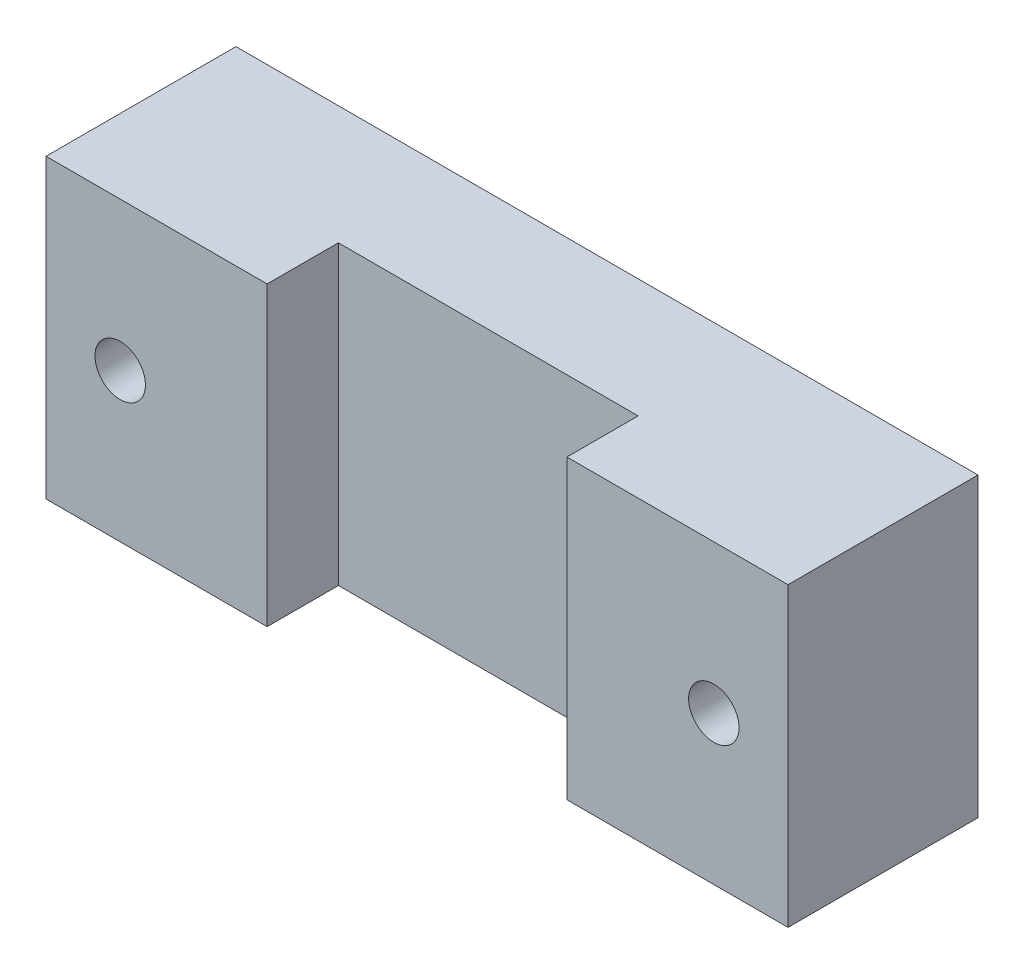
ISO-10303-21;
HEADER;
FILE_DESCRIPTION(('STEP AP214'),'2;1');
FILE_NAME('part.step','',(''),(''),'','','');
FILE_SCHEMA(('AUTOMOTIVE_DESIGN { 1 0 10303 214 1 1 1 1 }'));
ENDSEC;
DATA;
#1=APPLICATION_CONTEXT('core data for automotive mechanical design processes');
#2=APPLICATION_PROTOCOL_DEFINITION('international standard','automotive_design',2000,#1);
#3=PRODUCT_CONTEXT('',#1,'mechanical');
#4=PRODUCT('Part','Part','',(#3));
#5=PRODUCT_RELATED_PRODUCT_CATEGORY('part','',(#4));
#6=PRODUCT_DEFINITION_FORMATION('','',#4);
#7=PRODUCT_DEFINITION_CONTEXT('part definition',#1,'design');
#8=PRODUCT_DEFINITION('design','',#6,#7);
#9=PRODUCT_DEFINITION_SHAPE('','',#8);
#10=(LENGTH_UNIT() NAMED_UNIT(*) SI_UNIT(.MILLI.,.METRE.));
#11=(NAMED_UNIT(*) PLANE_ANGLE_UNIT() SI_UNIT($,.RADIAN.));
#12=(NAMED_UNIT(*) SI_UNIT($,.STERADIAN.) SOLID_ANGLE_UNIT());
#13=UNCERTAINTY_MEASURE_WITH_UNIT(LENGTH_MEASURE(1.E-05),#10,'distance_accuracy_value','');
#14=(GEOMETRIC_REPRESENTATION_CONTEXT(3) GLOBAL_UNCERTAINTY_ASSIGNED_CONTEXT((#13)) GLOBAL_UNIT_ASSIGNED_CONTEXT((#10,
#11,#12)) REPRESENTATION_CONTEXT('',''));
#15=CARTESIAN_POINT('',(0.,0.,0.));
#16=DIRECTION('',(0.,0.,1.));
#17=DIRECTION('',(1.,0.,0.));
#18=AXIS2_PLACEMENT_3D('',#15,#16,#17);
#19=CARTESIAN_POINT('',(0.,0.,8.));
#20=DIRECTION('',(0.,0.,1.));
#21=DIRECTION('',(1.,0.,0.));
#22=AXIS2_PLACEMENT_3D('',#19,#20,#21);
#23=PLANE('',#22);
#24=DIRECTION('',(0.,-1.,0.));
#25=VECTOR('',#24,1.);
#26=CARTESIAN_POINT('',(-10.1,61.6124016104657,8.));
#27=LINE('',#26,#25);
#28=CARTESIAN_POINT('',(-10.1,10.,8.));
#29=VERTEX_POINT('',#28);
#30=CARTESIAN_POINT('',(-10.1,-9.99999999999999,8.));
#31=VERTEX_POINT('',#30);
#32=EDGE_CURVE('E56',#29,#31,#27,.T.);
#33=ORIENTED_EDGE('',*,*,#32,.T.);
#34=DIRECTION('',(1.,0.,0.));
#35=VECTOR('',#34,1.);
#36=CARTESIAN_POINT('',(25.,-9.99999999999999,8.));
#37=LINE('',#36,#35);
#38=CARTESIAN_POINT('',(10.1,-9.99999999999999,8.));
#39=VERTEX_POINT('',#38);
#40=EDGE_CURVE('E51',#31,#39,#37,.T.);
#41=ORIENTED_EDGE('',*,*,#40,.T.);
#42=DIRECTION('',(0.,-1.,0.));
#43=VECTOR('',#42,1.);
#44=CARTESIAN_POINT('',(10.1,61.6124016104657,8.));
#45=LINE('',#44,#43);
#46=CARTESIAN_POINT('',(10.1,10.,8.));
#47=VERTEX_POINT('',#46);
#48=EDGE_CURVE('E144',#47,#39,#45,.T.);
#49=ORIENTED_EDGE('',*,*,#48,.F.);
#50=DIRECTION('',(-1.,0.,0.));
#51=VECTOR('',#50,1.);
#52=CARTESIAN_POINT('',(25.,10.,8.));
#53=LINE('',#52,#51);
#54=EDGE_CURVE('E148',#47,#29,#53,.T.);
#55=ORIENTED_EDGE('',*,*,#54,.T.);
#56=EDGE_LOOP('',(#33,#41,#49,#55));
#57=FACE_BOUND('',#56,.T.);
#58=ADVANCED_FACE('F34',(#57),#23,.T.);
#59=CARTESIAN_POINT('',(0.,0.,0.));
#60=DIRECTION('',(0.,0.,1.));
#61=DIRECTION('',(1.,0.,0.));
#62=AXIS2_PLACEMENT_3D('',#59,#60,#61);
#63=PLANE('',#62);
#64=CARTESIAN_POINT('',(20.,0.,0.));
#65=DIRECTION('',(0.,0.,-1.));
#66=DIRECTION('',(-1.,0.,0.));
#67=AXIS2_PLACEMENT_3D('',#64,#65,#66);
#68=CIRCLE('',#67,3.75);
#69=CARTESIAN_POINT('',(16.25,0.,0.));
#70=VERTEX_POINT('',#69);
#71=EDGE_CURVE('E187',#70,#70,#68,.T.);
#72=ORIENTED_EDGE('',*,*,#71,.F.);
#73=EDGE_LOOP('',(#72));
#74=FACE_BOUND('',#73,.T.);
#75=CARTESIAN_POINT('',(-20.,0.,0.));
#76=DIRECTION('',(0.,0.,-1.));
#77=DIRECTION('',(-1.,0.,0.));
#78=AXIS2_PLACEMENT_3D('',#75,#76,#77);
#79=CIRCLE('',#78,3.75);
#80=CARTESIAN_POINT('',(-23.75,0.,0.));
#81=VERTEX_POINT('',#80);
#82=EDGE_CURVE('E182',#81,#81,#79,.T.);
#83=ORIENTED_EDGE('',*,*,#82,.F.);
#84=EDGE_LOOP('',(#83));
#85=FACE_BOUND('',#84,.T.);
#86=DIRECTION('',(0.,-1.,0.));
#87=VECTOR('',#86,1.);
#88=CARTESIAN_POINT('',(-25.,-9.99999999999999,0.));
#89=LINE('',#88,#87);
#90=CARTESIAN_POINT('',(-25.,10.,0.));
#91=VERTEX_POINT('',#90);
#92=CARTESIAN_POINT('',(-25.,-9.99999999999999,0.));
#93=VERTEX_POINT('',#92);
#94=EDGE_CURVE('E152',#91,#93,#89,.T.);
#95=ORIENTED_EDGE('',*,*,#94,.F.);
#96=DIRECTION('',(-1.,0.,0.));
#97=VECTOR('',#96,1.);
#98=CARTESIAN_POINT('',(25.,10.,0.));
#99=LINE('',#98,#97);
#100=CARTESIAN_POINT('',(25.,10.,0.));
#101=VERTEX_POINT('',#100);
#102=EDGE_CURVE('E149',#101,#91,#99,.T.);
#103=ORIENTED_EDGE('',*,*,#102,.F.);
#104=DIRECTION('',(0.,1.,0.));
#105=VECTOR('',#104,1.);
#106=CARTESIAN_POINT('',(25.,-9.99999999999999,0.));
#107=LINE('',#106,#105);
#108=CARTESIAN_POINT('',(25.,-9.99999999999999,0.));
#109=VERTEX_POINT('',#108);
#110=EDGE_CURVE('E156',#109,#101,#107,.T.);
#111=ORIENTED_EDGE('',*,*,#110,.F.);
#112=DIRECTION('',(1.,0.,0.));
#113=VECTOR('',#112,1.);
#114=CARTESIAN_POINT('',(25.,-9.99999999999999,0.));
#115=LINE('',#114,#113);
#116=EDGE_CURVE('E104',#93,#109,#115,.T.);
#117=ORIENTED_EDGE('',*,*,#116,.F.);
#118=EDGE_LOOP('',(#95,#103,#111,#117));
#119=FACE_BOUND('',#118,.T.);
#120=ADVANCED_FACE('F166',(#74,#85,#119),#63,.F.);
#121=CARTESIAN_POINT('',(-25.,-9.99999999999999,8.));
#122=DIRECTION('',(1.,0.,0.));
#123=DIRECTION('',(0.,1.,0.));
#124=AXIS2_PLACEMENT_3D('',#121,#122,#123);
#125=PLANE('',#124);
#126=ORIENTED_EDGE('',*,*,#94,.T.);
#127=DIRECTION('',(0.,0.,-1.));
#128=VECTOR('',#127,1.);
#129=CARTESIAN_POINT('',(-25.,-9.99999999999999,8.));
#130=LINE('',#129,#128);
#131=CARTESIAN_POINT('',(-25.,-9.99999999999999,12.8));
#132=VERTEX_POINT('',#131);
#133=EDGE_CURVE('E11',#132,#93,#130,.T.);
#134=ORIENTED_EDGE('',*,*,#133,.F.);
#135=DIRECTION('',(0.,-1.,0.));
#136=VECTOR('',#135,1.);
#137=CARTESIAN_POINT('',(-25.,61.6124016104657,12.8));
#138=LINE('',#137,#136);
#139=CARTESIAN_POINT('',(-25.,10.,12.8));
#140=VERTEX_POINT('',#139);
#141=EDGE_CURVE('E137',#140,#132,#138,.T.);
#142=ORIENTED_EDGE('',*,*,#141,.F.);
#143=DIRECTION('',(0.,0.,-1.));
#144=VECTOR('',#143,1.);
#145=CARTESIAN_POINT('',(-25.,10.,8.));
#146=LINE('',#145,#144);
#147=EDGE_CURVE('E151',#140,#91,#146,.T.);
#148=ORIENTED_EDGE('',*,*,#147,.T.);
#149=EDGE_LOOP('',(#126,#134,#142,#148));
#150=FACE_BOUND('',#149,.T.);
#151=ADVANCED_FACE('F36',(#150),#125,.F.);
#152=CARTESIAN_POINT('',(25.,-9.99999999999999,8.));
#153=DIRECTION('',(0.,1.,0.));
#154=DIRECTION('',(-1.,0.,0.));
#155=AXIS2_PLACEMENT_3D('',#152,#153,#154);
#156=PLANE('',#155);
#157=ORIENTED_EDGE('',*,*,#116,.T.);
#158=DIRECTION('',(0.,0.,-1.));
#159=VECTOR('',#158,1.);
#160=CARTESIAN_POINT('',(25.,-9.99999999999999,8.));
#161=LINE('',#160,#159);
#162=CARTESIAN_POINT('',(25.,-9.99999999999999,12.8));
#163=VERTEX_POINT('',#162);
#164=EDGE_CURVE('E43',#163,#109,#161,.T.);
#165=ORIENTED_EDGE('',*,*,#164,.F.);
#166=DIRECTION('',(-1.,0.,0.));
#167=VECTOR('',#166,1.);
#168=CARTESIAN_POINT('',(10.1,-9.99999999999999,12.8));
#169=LINE('',#168,#167);
#170=CARTESIAN_POINT('',(10.1,-9.99999999999999,12.8));
#171=VERTEX_POINT('',#170);
#172=EDGE_CURVE('E103',#163,#171,#169,.T.);
#173=ORIENTED_EDGE('',*,*,#172,.T.);
#174=DIRECTION('',(0.,0.,-1.));
#175=VECTOR('',#174,1.);
#176=CARTESIAN_POINT('',(10.1,-9.99999999999999,8.));
#177=LINE('',#176,#175);
#178=EDGE_CURVE('E122',#171,#39,#177,.T.);
#179=ORIENTED_EDGE('',*,*,#178,.T.);
#180=ORIENTED_EDGE('',*,*,#40,.F.);
#181=DIRECTION('',(0.,0.,1.));
#182=VECTOR('',#181,1.);
#183=CARTESIAN_POINT('',(-10.1,-9.99999999999999,12.8));
#184=LINE('',#183,#182);
#185=CARTESIAN_POINT('',(-10.1,-9.99999999999999,12.8));
#186=VERTEX_POINT('',#185);
#187=EDGE_CURVE('E125',#31,#186,#184,.T.);
#188=ORIENTED_EDGE('',*,*,#187,.T.);
#189=DIRECTION('',(-1.,0.,0.));
#190=VECTOR('',#189,1.);
#191=CARTESIAN_POINT('',(-25.,-9.99999999999999,12.8));
#192=LINE('',#191,#190);
#193=EDGE_CURVE('E117',#186,#132,#192,.T.);
#194=ORIENTED_EDGE('',*,*,#193,.T.);
#195=ORIENTED_EDGE('',*,*,#133,.T.);
#196=EDGE_LOOP('',(#157,#165,#173,#179,#180,#188,#194,#195));
#197=FACE_BOUND('',#196,.T.);
#198=ADVANCED_FACE('F100',(#197),#156,.F.);
#199=CARTESIAN_POINT('',(25.,-9.99999999999999,8.));
#200=DIRECTION('',(-1.,0.,0.));
#201=DIRECTION('',(0.,-1.,0.));
#202=AXIS2_PLACEMENT_3D('',#199,#200,#201);
#203=PLANE('',#202);
#204=ORIENTED_EDGE('',*,*,#110,.T.);
#205=DIRECTION('',(0.,0.,-1.));
#206=VECTOR('',#205,1.);
#207=CARTESIAN_POINT('',(25.,10.,8.));
#208=LINE('',#207,#206);
#209=CARTESIAN_POINT('',(25.,10.,12.8));
#210=VERTEX_POINT('',#209);
#211=EDGE_CURVE('E107',#210,#101,#208,.T.);
#212=ORIENTED_EDGE('',*,*,#211,.F.);
#213=DIRECTION('',(0.,-1.,0.));
#214=VECTOR('',#213,1.);
#215=CARTESIAN_POINT('',(25.,61.6124016104657,12.8));
#216=LINE('',#215,#214);
#217=EDGE_CURVE('E110',#210,#163,#216,.T.);
#218=ORIENTED_EDGE('',*,*,#217,.T.);
#219=ORIENTED_EDGE('',*,*,#164,.T.);
#220=EDGE_LOOP('',(#204,#212,#218,#219));
#221=FACE_BOUND('',#220,.T.);
#222=ADVANCED_FACE('F111',(#221),#203,.F.);
#223=CARTESIAN_POINT('',(25.,10.,8.));
#224=DIRECTION('',(0.,-1.,0.));
#225=DIRECTION('',(1.,0.,0.));
#226=AXIS2_PLACEMENT_3D('',#223,#224,#225);
#227=PLANE('',#226);
#228=ORIENTED_EDGE('',*,*,#102,.T.);
#229=ORIENTED_EDGE('',*,*,#147,.F.);
#230=DIRECTION('',(1.,0.,0.));
#231=VECTOR('',#230,1.);
#232=CARTESIAN_POINT('',(-25.,10.,12.8));
#233=LINE('',#232,#231);
#234=CARTESIAN_POINT('',(-10.1,10.,12.8));
#235=VERTEX_POINT('',#234);
#236=EDGE_CURVE('E130',#140,#235,#233,.T.);
#237=ORIENTED_EDGE('',*,*,#236,.T.);
#238=DIRECTION('',(0.,0.,-1.));
#239=VECTOR('',#238,1.);
#240=CARTESIAN_POINT('',(-10.1,10.,12.8));
#241=LINE('',#240,#239);
#242=EDGE_CURVE('E176',#235,#29,#241,.T.);
#243=ORIENTED_EDGE('',*,*,#242,.T.);
#244=ORIENTED_EDGE('',*,*,#54,.F.);
#245=DIRECTION('',(0.,0.,1.));
#246=VECTOR('',#245,1.);
#247=CARTESIAN_POINT('',(10.1,10.,8.));
#248=LINE('',#247,#246);
#249=CARTESIAN_POINT('',(10.1,10.,12.8));
#250=VERTEX_POINT('',#249);
#251=EDGE_CURVE('E177',#47,#250,#248,.T.);
#252=ORIENTED_EDGE('',*,*,#251,.T.);
#253=DIRECTION('',(1.,0.,0.));
#254=VECTOR('',#253,1.);
#255=CARTESIAN_POINT('',(10.1,10.,12.8));
#256=LINE('',#255,#254);
#257=EDGE_CURVE('E140',#250,#210,#256,.T.);
#258=ORIENTED_EDGE('',*,*,#257,.T.);
#259=ORIENTED_EDGE('',*,*,#211,.T.);
#260=EDGE_LOOP('',(#228,#229,#237,#243,#244,#252,#258,#259));
#261=FACE_BOUND('',#260,.T.);
#262=ADVANCED_FACE('F163',(#261),#227,.F.);
#263=CARTESIAN_POINT('',(10.1,61.6124016104657,12.8));
#264=DIRECTION('',(0.,0.,1.));
#265=DIRECTION('',(1.,0.,0.));
#266=AXIS2_PLACEMENT_3D('',#263,#264,#265);
#267=PLANE('',#266);
#268=CARTESIAN_POINT('',(20.,0.,12.8));
#269=DIRECTION('',(0.,0.,-1.));
#270=DIRECTION('',(-1.,0.,0.));
#271=AXIS2_PLACEMENT_3D('',#268,#269,#270);
#272=CIRCLE('',#271,1.7);
#273=CARTESIAN_POINT('',(18.3,0.,12.8));
#274=VERTEX_POINT('',#273);
#275=EDGE_CURVE('E196',#274,#274,#272,.T.);
#276=ORIENTED_EDGE('',*,*,#275,.T.);
#277=EDGE_LOOP('',(#276));
#278=FACE_BOUND('',#277,.T.);
#279=ORIENTED_EDGE('',*,*,#257,.F.);
#280=DIRECTION('',(0.,-1.,0.));
#281=VECTOR('',#280,1.);
#282=CARTESIAN_POINT('',(10.1,61.6124016104657,12.8));
#283=LINE('',#282,#281);
#284=EDGE_CURVE('E116',#250,#171,#283,.T.);
#285=ORIENTED_EDGE('',*,*,#284,.T.);
#286=ORIENTED_EDGE('',*,*,#172,.F.);
#287=ORIENTED_EDGE('',*,*,#217,.F.);
#288=EDGE_LOOP('',(#279,#285,#286,#287));
#289=FACE_BOUND('',#288,.T.);
#290=ADVANCED_FACE('F119',(#278,#289),#267,.T.);
#291=CARTESIAN_POINT('',(10.1,61.6124016104657,8.));
#292=DIRECTION('',(-1.,0.,0.));
#293=DIRECTION('',(0.,-1.,0.));
#294=AXIS2_PLACEMENT_3D('',#291,#292,#293);
#295=PLANE('',#294);
#296=ORIENTED_EDGE('',*,*,#251,.F.);
#297=ORIENTED_EDGE('',*,*,#48,.T.);
#298=ORIENTED_EDGE('',*,*,#178,.F.);
#299=ORIENTED_EDGE('',*,*,#284,.F.);
#300=EDGE_LOOP('',(#296,#297,#298,#299));
#301=FACE_BOUND('',#300,.T.);
#302=ADVANCED_FACE('F292',(#301),#295,.T.);
#303=CARTESIAN_POINT('',(-25.,61.6124016104657,12.8));
#304=DIRECTION('',(0.,0.,1.));
#305=DIRECTION('',(1.,0.,0.));
#306=AXIS2_PLACEMENT_3D('',#303,#304,#305);
#307=PLANE('',#306);
#308=CARTESIAN_POINT('',(-20.,0.,12.8));
#309=DIRECTION('',(0.,0.,-1.));
#310=DIRECTION('',(-1.,0.,0.));
#311=AXIS2_PLACEMENT_3D('',#308,#309,#310);
#312=CIRCLE('',#311,1.7);
#313=CARTESIAN_POINT('',(-21.7,0.,12.8));
#314=VERTEX_POINT('',#313);
#315=EDGE_CURVE('E191',#314,#314,#312,.T.);
#316=ORIENTED_EDGE('',*,*,#315,.T.);
#317=EDGE_LOOP('',(#316));
#318=FACE_BOUND('',#317,.T.);
#319=ORIENTED_EDGE('',*,*,#236,.F.);
#320=ORIENTED_EDGE('',*,*,#141,.T.);
#321=ORIENTED_EDGE('',*,*,#193,.F.);
#322=DIRECTION('',(0.,-1.,0.));
#323=VECTOR('',#322,1.);
#324=CARTESIAN_POINT('',(-10.1,61.6124016104657,12.8));
#325=LINE('',#324,#323);
#326=EDGE_CURVE('E141',#235,#186,#325,.T.);
#327=ORIENTED_EDGE('',*,*,#326,.F.);
#328=EDGE_LOOP('',(#319,#320,#321,#327));
#329=FACE_BOUND('',#328,.T.);
#330=ADVANCED_FACE('F174',(#318,#329),#307,.T.);
#331=CARTESIAN_POINT('',(-10.1,61.6124016104657,12.8));
#332=DIRECTION('',(1.,0.,0.));
#333=DIRECTION('',(0.,1.,0.));
#334=AXIS2_PLACEMENT_3D('',#331,#332,#333);
#335=PLANE('',#334);
#336=ORIENTED_EDGE('',*,*,#242,.F.);
#337=ORIENTED_EDGE('',*,*,#326,.T.);
#338=ORIENTED_EDGE('',*,*,#187,.F.);
#339=ORIENTED_EDGE('',*,*,#32,.F.);
#340=EDGE_LOOP('',(#336,#337,#338,#339));
#341=FACE_BOUND('',#340,.T.);
#342=ADVANCED_FACE('F245',(#341),#335,.T.);
#343=CARTESIAN_POINT('',(-20.,0.,4.));
#344=DIRECTION('',(0.,0.,-1.));
#345=DIRECTION('',(-1.,0.,0.));
#346=AXIS2_PLACEMENT_3D('',#343,#344,#345);
#347=CYLINDRICAL_SURFACE('',#346,3.75);
#348=CARTESIAN_POINT('',(-20.,0.,4.));
#349=DIRECTION('',(0.,0.,-1.));
#350=DIRECTION('',(-1.,0.,0.));
#351=AXIS2_PLACEMENT_3D('',#348,#349,#350);
#352=CIRCLE('',#351,3.75);
#353=CARTESIAN_POINT('',(-23.75,0.,4.));
#354=VERTEX_POINT('',#353);
#355=EDGE_CURVE('E128',#354,#354,#352,.T.);
#356=ORIENTED_EDGE('',*,*,#355,.F.);
#357=EDGE_LOOP('',(#356));
#358=FACE_BOUND('',#357,.T.);
#359=ORIENTED_EDGE('',*,*,#82,.T.);
#360=EDGE_LOOP('',(#359));
#361=FACE_BOUND('',#360,.T.);
#362=ADVANCED_FACE('F250',(#358,#361),#347,.F.);
#363=CARTESIAN_POINT('',(-20.,0.,4.));
#364=DIRECTION('',(0.,0.,-1.));
#365=DIRECTION('',(-1.,0.,0.));
#366=AXIS2_PLACEMENT_3D('',#363,#364,#365);
#367=PLANE('',#366);
#368=CARTESIAN_POINT('',(-20.,0.,4.));
#369=DIRECTION('',(0.,0.,-1.));
#370=DIRECTION('',(-1.,0.,0.));
#371=AXIS2_PLACEMENT_3D('',#368,#369,#370);
#372=CIRCLE('',#371,1.7);
#373=CARTESIAN_POINT('',(-21.7,0.,4.));
#374=VERTEX_POINT('',#373);
#375=EDGE_CURVE('E123',#374,#374,#372,.T.);
#376=ORIENTED_EDGE('',*,*,#375,.F.);
#377=EDGE_LOOP('',(#376));
#378=FACE_BOUND('',#377,.T.);
#379=ORIENTED_EDGE('',*,*,#355,.T.);
#380=EDGE_LOOP('',(#379));
#381=FACE_BOUND('',#380,.T.);
#382=ADVANCED_FACE('F255',(#378,#381),#367,.T.);
#383=CARTESIAN_POINT('',(-20.,0.,8.));
#384=DIRECTION('',(0.,0.,-1.));
#385=DIRECTION('',(-1.,0.,0.));
#386=AXIS2_PLACEMENT_3D('',#383,#384,#385);
#387=CYLINDRICAL_SURFACE('',#386,1.7);
#388=ORIENTED_EDGE('',*,*,#375,.T.);
#389=EDGE_LOOP('',(#388));
#390=FACE_BOUND('',#389,.T.);
#391=ORIENTED_EDGE('',*,*,#315,.F.);
#392=EDGE_LOOP('',(#391));
#393=FACE_BOUND('',#392,.T.);
#394=ADVANCED_FACE('F222',(#390,#393),#387,.F.);
#395=CARTESIAN_POINT('',(20.,0.,4.));
#396=DIRECTION('',(0.,0.,-1.));
#397=DIRECTION('',(-1.,0.,0.));
#398=AXIS2_PLACEMENT_3D('',#395,#396,#397);
#399=CYLINDRICAL_SURFACE('',#398,3.75);
#400=CARTESIAN_POINT('',(20.,0.,4.));
#401=DIRECTION('',(0.,0.,-1.));
#402=DIRECTION('',(-1.,0.,0.));
#403=AXIS2_PLACEMENT_3D('',#400,#401,#402);
#404=CIRCLE('',#403,3.75);
#405=CARTESIAN_POINT('',(16.25,0.,4.));
#406=VERTEX_POINT('',#405);
#407=EDGE_CURVE('E190',#406,#406,#404,.T.);
#408=ORIENTED_EDGE('',*,*,#407,.F.);
#409=EDGE_LOOP('',(#408));
#410=FACE_BOUND('',#409,.T.);
#411=ORIENTED_EDGE('',*,*,#71,.T.);
#412=EDGE_LOOP('',(#411));
#413=FACE_BOUND('',#412,.T.);
#414=ADVANCED_FACE('F209',(#410,#413),#399,.F.);
#415=CARTESIAN_POINT('',(20.,0.,4.));
#416=DIRECTION('',(0.,0.,-1.));
#417=DIRECTION('',(-1.,0.,0.));
#418=AXIS2_PLACEMENT_3D('',#415,#416,#417);
#419=PLANE('',#418);
#420=CARTESIAN_POINT('',(20.,0.,4.));
#421=DIRECTION('',(0.,0.,-1.));
#422=DIRECTION('',(-1.,0.,0.));
#423=AXIS2_PLACEMENT_3D('',#420,#421,#422);
#424=CIRCLE('',#423,1.7);
#425=CARTESIAN_POINT('',(18.3,0.,4.));
#426=VERTEX_POINT('',#425);
#427=EDGE_CURVE('E38',#426,#426,#424,.T.);
#428=ORIENTED_EDGE('',*,*,#427,.F.);
#429=EDGE_LOOP('',(#428));
#430=FACE_BOUND('',#429,.T.);
#431=ORIENTED_EDGE('',*,*,#407,.T.);
#432=EDGE_LOOP('',(#431));
#433=FACE_BOUND('',#432,.T.);
#434=ADVANCED_FACE('F203',(#430,#433),#419,.T.);
#435=CARTESIAN_POINT('',(20.,0.,8.));
#436=DIRECTION('',(0.,0.,-1.));
#437=DIRECTION('',(-1.,0.,0.));
#438=AXIS2_PLACEMENT_3D('',#435,#436,#437);
#439=CYLINDRICAL_SURFACE('',#438,1.7);
#440=ORIENTED_EDGE('',*,*,#427,.T.);
#441=EDGE_LOOP('',(#440));
#442=FACE_BOUND('',#441,.T.);
#443=ORIENTED_EDGE('',*,*,#275,.F.);
#444=EDGE_LOOP('',(#443));
#445=FACE_BOUND('',#444,.T.);
#446=ADVANCED_FACE('F201',(#442,#445),#439,.F.);
#447=CLOSED_SHELL('',(#58,#120,#151,#198,#222,#262,#290,#302,#330,#342,#362,#382,#394,#414,#434,#446));
#448=MANIFOLD_SOLID_BREP('B2',#447);
#449=ADVANCED_BREP_SHAPE_REPRESENTATION('',(#18,#448),#14);
#450=SHAPE_DEFINITION_REPRESENTATION(#9,#449);
ENDSEC;
END-ISO-10303-21;
